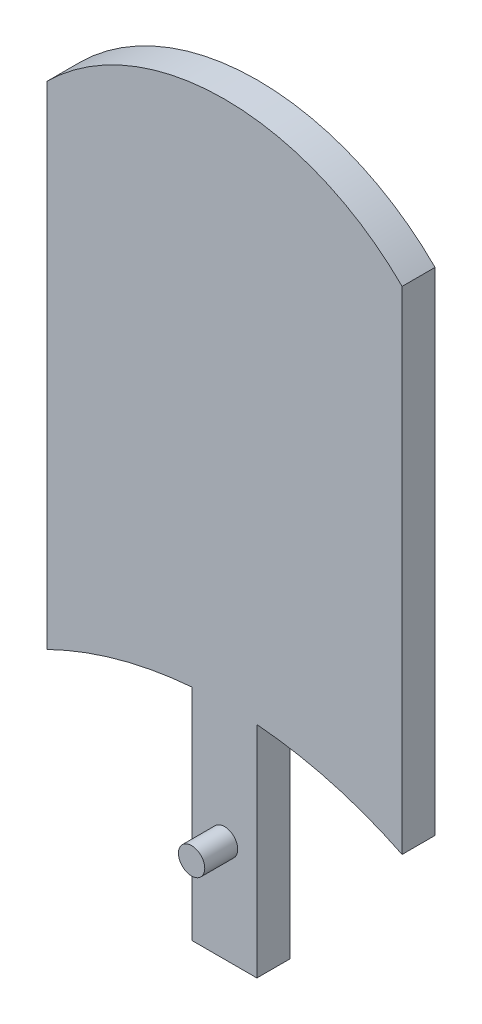
ISO-10303-21;
HEADER;
FILE_DESCRIPTION(('STEP AP214'),'2;1');
FILE_NAME('part.step','',(''),(''),'','','');
FILE_SCHEMA(('AUTOMOTIVE_DESIGN { 1 0 10303 214 1 1 1 1 }'));
ENDSEC;
DATA;
#1=APPLICATION_CONTEXT('core data for automotive mechanical design processes');
#2=APPLICATION_PROTOCOL_DEFINITION('international standard','automotive_design',2000,#1);
#3=PRODUCT_CONTEXT('',#1,'mechanical');
#4=PRODUCT('Part','Part','',(#3));
#5=PRODUCT_RELATED_PRODUCT_CATEGORY('part','',(#4));
#6=PRODUCT_DEFINITION_FORMATION('','',#4);
#7=PRODUCT_DEFINITION_CONTEXT('part definition',#1,'design');
#8=PRODUCT_DEFINITION('design','',#6,#7);
#9=PRODUCT_DEFINITION_SHAPE('','',#8);
#10=(LENGTH_UNIT() NAMED_UNIT(*) SI_UNIT(.MILLI.,.METRE.));
#11=(NAMED_UNIT(*) PLANE_ANGLE_UNIT() SI_UNIT($,.RADIAN.));
#12=(NAMED_UNIT(*) SI_UNIT($,.STERADIAN.) SOLID_ANGLE_UNIT());
#13=UNCERTAINTY_MEASURE_WITH_UNIT(LENGTH_MEASURE(1.E-05),#10,'distance_accuracy_value','');
#14=(GEOMETRIC_REPRESENTATION_CONTEXT(3) GLOBAL_UNCERTAINTY_ASSIGNED_CONTEXT((#13)) GLOBAL_UNIT_ASSIGNED_CONTEXT((#10,
#11,#12)) REPRESENTATION_CONTEXT('',''));
#15=CARTESIAN_POINT('',(0.,0.,0.));
#16=DIRECTION('',(0.,0.,1.));
#17=DIRECTION('',(1.,0.,0.));
#18=AXIS2_PLACEMENT_3D('',#15,#16,#17);
#19=CARTESIAN_POINT('',(0.,23.2983529403055,-3.175));
#20=DIRECTION('',(0.,1.,0.));
#21=DIRECTION('',(0.,0.,1.));
#22=AXIS2_PLACEMENT_3D('',#19,#20,#21);
#23=PLANE('',#22);
#24=DIRECTION('',(0.,0.,-1.));
#25=VECTOR('',#24,1.);
#26=CARTESIAN_POINT('',(0.888999999999995,23.2983529403055,6.351));
#27=LINE('',#26,#25);
#28=CARTESIAN_POINT('',(0.888999999999995,23.2983529403055,-1.972861942));
#29=VERTEX_POINT('',#28);
#30=CARTESIAN_POINT('',(0.888999999999995,23.2983529403055,-3.175));
#31=VERTEX_POINT('',#30);
#32=EDGE_CURVE('E452',#29,#31,#27,.T.);
#33=ORIENTED_EDGE('',*,*,#32,.F.);
#34=DIRECTION('',(1.,0.,0.));
#35=VECTOR('',#34,1.);
#36=CARTESIAN_POINT('',(-17.1162533328683,23.2983529403055,-1.972861942));
#37=LINE('',#36,#35);
#38=CARTESIAN_POINT('',(1.65128861988301,23.2983529403055,-1.972861942));
#39=VERTEX_POINT('',#38);
#40=EDGE_CURVE('E216',#29,#39,#37,.T.);
#41=ORIENTED_EDGE('',*,*,#40,.T.);
#42=DIRECTION('',(0.,0.,1.));
#43=VECTOR('',#42,1.);
#44=CARTESIAN_POINT('',(1.65128861988301,23.2983529403055,-3.175));
#45=LINE('',#44,#43);
#46=CARTESIAN_POINT('',(1.65128861988301,23.2983529403055,0.));
#47=VERTEX_POINT('',#46);
#48=EDGE_CURVE('E312',#39,#47,#45,.T.);
#49=ORIENTED_EDGE('',*,*,#48,.T.);
#50=DIRECTION('',(-1.,0.,0.));
#51=VECTOR('',#50,1.);
#52=CARTESIAN_POINT('',(0.,23.2983529403055,0.));
#53=LINE('',#52,#51);
#54=CARTESIAN_POINT('',(2.85342673515783,23.2983529403055,0.));
#55=VERTEX_POINT('',#54);
#56=EDGE_CURVE('E292',#55,#47,#53,.T.);
#57=ORIENTED_EDGE('',*,*,#56,.F.);
#58=DIRECTION('',(0.,0.,1.));
#59=VECTOR('',#58,1.);
#60=CARTESIAN_POINT('',(2.85342673515783,23.2983529403055,-3.175));
#61=LINE('',#60,#59);
#62=CARTESIAN_POINT('',(2.85342673515783,23.2983529403055,-3.175));
#63=VERTEX_POINT('',#62);
#64=EDGE_CURVE('E308',#63,#55,#61,.T.);
#65=ORIENTED_EDGE('',*,*,#64,.F.);
#66=DIRECTION('',(-1.,0.,0.));
#67=VECTOR('',#66,1.);
#68=CARTESIAN_POINT('',(0.,23.2983529403055,-3.175));
#69=LINE('',#68,#67);
#70=EDGE_CURVE('E274',#63,#31,#69,.T.);
#71=ORIENTED_EDGE('',*,*,#70,.T.);
#72=EDGE_LOOP('',(#33,#41,#49,#57,#65,#71));
#73=FACE_BOUND('',#72,.T.);
#74=ADVANCED_FACE('F47',(#73),#23,.T.);
#75=CARTESIAN_POINT('',(0.,0.,-3.175));
#76=DIRECTION('',(0.,0.,-1.));
#77=DIRECTION('',(-1.,0.,0.));
#78=AXIS2_PLACEMENT_3D('',#75,#76,#77);
#79=PLANE('',#78);
#80=DIRECTION('',(0.,-1.,0.));
#81=VECTOR('',#80,1.);
#82=CARTESIAN_POINT('',(0.888999999999995,-19.7679282566195,-3.175));
#83=LINE('',#82,#81);
#84=CARTESIAN_POINT('',(0.888999999999994,-19.7679282566195,-3.175));
#85=VERTEX_POINT('',#84);
#86=EDGE_CURVE('E71',#31,#85,#83,.T.);
#87=ORIENTED_EDGE('',*,*,#86,.F.);
#88=ORIENTED_EDGE('',*,*,#70,.F.);
#89=DIRECTION('',(0.,1.,0.));
#90=VECTOR('',#89,1.);
#91=CARTESIAN_POINT('',(2.85342673515783,0.,-3.175));
#92=LINE('',#91,#90);
#93=CARTESIAN_POINT('',(2.85342673515783,-19.8377816235629,-3.175));
#94=VERTEX_POINT('',#93);
#95=EDGE_CURVE('E278',#94,#63,#92,.T.);
#96=ORIENTED_EDGE('',*,*,#95,.F.);
#97=CARTESIAN_POINT('',(0.,-58.5646946603465,-3.175));
#98=DIRECTION('',(0.,0.,-1.));
#99=DIRECTION('',(-1.,0.,0.));
#100=AXIS2_PLACEMENT_3D('',#97,#98,#99);
#101=CIRCLE('',#100,38.8318920153463);
#102=CARTESIAN_POINT('',(1.65128861988301,-19.7679282566195,-3.175));
#103=VERTEX_POINT('',#102);
#104=EDGE_CURVE('E283',#94,#103,#101,.F.);
#105=ORIENTED_EDGE('',*,*,#104,.T.);
#106=DIRECTION('',(1.,0.,0.));
#107=VECTOR('',#106,1.);
#108=CARTESIAN_POINT('',(-17.1162533328683,-19.7679282566195,-3.175));
#109=LINE('',#108,#107);
#110=EDGE_CURVE('E446',#85,#103,#109,.T.);
#111=ORIENTED_EDGE('',*,*,#110,.F.);
#112=EDGE_LOOP('',(#87,#88,#96,#105,#111));
#113=FACE_BOUND('',#112,.T.);
#114=ADVANCED_FACE('F451',(#113),#79,.T.);
#115=CARTESIAN_POINT('',(-17.1162533328683,23.2983529403055,-1.972861942));
#116=DIRECTION('',(0.,0.,-1.));
#117=DIRECTION('',(0.,1.,0.));
#118=AXIS2_PLACEMENT_3D('',#115,#116,#117);
#119=PLANE('',#118);
#120=ORIENTED_EDGE('',*,*,#40,.F.);
#121=DIRECTION('',(0.,1.,0.));
#122=VECTOR('',#121,1.);
#123=CARTESIAN_POINT('',(0.888999999999995,-19.7679282566195,-1.972861942));
#124=LINE('',#123,#122);
#125=CARTESIAN_POINT('',(0.888999999999995,-19.7679282566195,-1.97286194199999));
#126=VERTEX_POINT('',#125);
#127=EDGE_CURVE('E208',#126,#29,#124,.T.);
#128=ORIENTED_EDGE('',*,*,#127,.F.);
#129=DIRECTION('',(1.,0.,0.));
#130=VECTOR('',#129,1.);
#131=CARTESIAN_POINT('',(-17.1162533328683,-19.7679282566195,-1.97286194199999));
#132=LINE('',#131,#130);
#133=CARTESIAN_POINT('',(1.65128861988301,-19.7679282566195,-1.97286194199999));
#134=VERTEX_POINT('',#133);
#135=EDGE_CURVE('E444',#126,#134,#132,.T.);
#136=ORIENTED_EDGE('',*,*,#135,.T.);
#137=DIRECTION('',(0.,1.,0.));
#138=VECTOR('',#137,1.);
#139=CARTESIAN_POINT('',(1.65128861988301,23.2983529403055,-1.972861942));
#140=LINE('',#139,#138);
#141=EDGE_CURVE('E215',#134,#39,#140,.T.);
#142=ORIENTED_EDGE('',*,*,#141,.T.);
#143=EDGE_LOOP('',(#120,#128,#136,#142));
#144=FACE_BOUND('',#143,.T.);
#145=ADVANCED_FACE('F457',(#144),#119,.F.);
#146=CARTESIAN_POINT('',(-17.1162533328683,-19.7679282566195,-1.97286194199999));
#147=DIRECTION('',(0.,1.,0.));
#148=DIRECTION('',(0.,0.,1.));
#149=AXIS2_PLACEMENT_3D('',#146,#147,#148);
#150=PLANE('',#149);
#151=ORIENTED_EDGE('',*,*,#135,.F.);
#152=DIRECTION('',(0.,0.,-1.));
#153=VECTOR('',#152,1.);
#154=CARTESIAN_POINT('',(0.888999999999995,-19.7679282566195,6.351));
#155=LINE('',#154,#153);
#156=EDGE_CURVE('E447',#126,#85,#155,.T.);
#157=ORIENTED_EDGE('',*,*,#156,.T.);
#158=ORIENTED_EDGE('',*,*,#110,.T.);
#159=DIRECTION('',(0.,0.,1.));
#160=VECTOR('',#159,1.);
#161=CARTESIAN_POINT('',(1.65128861988301,-19.7679282566195,-3.175));
#162=LINE('',#161,#160);
#163=EDGE_CURVE('E300',#103,#134,#162,.T.);
#164=ORIENTED_EDGE('',*,*,#163,.T.);
#165=EDGE_LOOP('',(#151,#157,#158,#164));
#166=FACE_BOUND('',#165,.T.);
#167=ADVANCED_FACE('F443',(#166),#150,.F.);
#168=CARTESIAN_POINT('',(-1.65128861988301,0.,-3.175));
#169=DIRECTION('',(1.,0.,0.));
#170=DIRECTION('',(0.,0.,-1.));
#171=AXIS2_PLACEMENT_3D('',#168,#169,#170);
#172=PLANE('',#171);
#173=DIRECTION('',(0.,0.,1.));
#174=VECTOR('',#173,1.);
#175=CARTESIAN_POINT('',(-1.65128861988301,-19.7679282566195,-3.175));
#176=LINE('',#175,#174);
#177=CARTESIAN_POINT('',(-1.65128861988301,-19.7679282566195,-1.97286194199999));
#178=VERTEX_POINT('',#177);
#179=CARTESIAN_POINT('',(-1.65128861988301,-19.7679282566195,0.));
#180=VERTEX_POINT('',#179);
#181=EDGE_CURVE('E325',#178,#180,#176,.T.);
#182=ORIENTED_EDGE('',*,*,#181,.F.);
#183=DIRECTION('',(0.,-1.,0.));
#184=VECTOR('',#183,1.);
#185=CARTESIAN_POINT('',(-1.65128861988301,23.2983529403055,-1.972861942));
#186=LINE('',#185,#184);
#187=CARTESIAN_POINT('',(-1.65128861988301,23.2983529403055,-1.972861942));
#188=VERTEX_POINT('',#187);
#189=EDGE_CURVE('E196',#188,#178,#186,.T.);
#190=ORIENTED_EDGE('',*,*,#189,.F.);
#191=DIRECTION('',(0.,0.,1.));
#192=VECTOR('',#191,1.);
#193=CARTESIAN_POINT('',(-1.65128861988301,23.2983529403055,-3.175));
#194=LINE('',#193,#192);
#195=CARTESIAN_POINT('',(-1.65128861988301,23.2983529403055,0.));
#196=VERTEX_POINT('',#195);
#197=EDGE_CURVE('E213',#188,#196,#194,.T.);
#198=ORIENTED_EDGE('',*,*,#197,.T.);
#199=DIRECTION('',(0.,1.,0.));
#200=VECTOR('',#199,1.);
#201=CARTESIAN_POINT('',(-1.65128861988301,0.,0.));
#202=LINE('',#201,#200);
#203=EDGE_CURVE('E321',#180,#196,#202,.T.);
#204=ORIENTED_EDGE('',*,*,#203,.F.);
#205=EDGE_LOOP('',(#182,#190,#198,#204));
#206=FACE_BOUND('',#205,.T.);
#207=ADVANCED_FACE('F514',(#206),#172,.T.);
#208=CARTESIAN_POINT('',(1.65128861988301,0.,-3.175));
#209=DIRECTION('',(1.,0.,0.));
#210=DIRECTION('',(0.,0.,-1.));
#211=AXIS2_PLACEMENT_3D('',#208,#209,#210);
#212=PLANE('',#211);
#213=ORIENTED_EDGE('',*,*,#141,.F.);
#214=CARTESIAN_POINT('',(1.65128861988301,-19.7679282566195,0.));
#215=VERTEX_POINT('',#214);
#216=EDGE_CURVE('E287',#134,#215,#162,.T.);
#217=ORIENTED_EDGE('',*,*,#216,.T.);
#218=DIRECTION('',(0.,1.,0.));
#219=VECTOR('',#218,1.);
#220=CARTESIAN_POINT('',(1.65128861988301,0.,0.));
#221=LINE('',#220,#219);
#222=EDGE_CURVE('E288',#215,#47,#221,.T.);
#223=ORIENTED_EDGE('',*,*,#222,.T.);
#224=ORIENTED_EDGE('',*,*,#48,.F.);
#225=EDGE_LOOP('',(#213,#217,#223,#224));
#226=FACE_BOUND('',#225,.T.);
#227=ADVANCED_FACE('F440',(#226),#212,.F.);
#228=CARTESIAN_POINT('',(0.,-58.5646946603465,3.175));
#229=DIRECTION('',(0.,0.,-1.));
#230=DIRECTION('',(-1.,0.,0.));
#231=AXIS2_PLACEMENT_3D('',#228,#229,#230);
#232=CYLINDRICAL_SURFACE('',#231,38.8318920153463);
#233=CARTESIAN_POINT('',(0.,-58.5646946603465,3.175));
#234=DIRECTION('',(0.,0.,1.));
#235=DIRECTION('',(1.,0.,0.));
#236=AXIS2_PLACEMENT_3D('',#233,#234,#235);
#237=CIRCLE('',#236,38.8318920153463);
#238=CARTESIAN_POINT('',(3.11847985069032,-19.8582233549904,3.175));
#239=VERTEX_POINT('',#238);
#240=CARTESIAN_POINT('',(17.1142533328683,-23.707583903,3.175));
#241=VERTEX_POINT('',#240);
#242=EDGE_CURVE('E357',#239,#241,#237,.F.);
#243=ORIENTED_EDGE('',*,*,#242,.F.);
#244=DIRECTION('',(0.,0.,-1.));
#245=VECTOR('',#244,1.);
#246=CARTESIAN_POINT('',(3.11847985069032,-19.8582233549904,3.175));
#247=LINE('',#246,#245);
#248=CARTESIAN_POINT('',(3.11847985069032,-19.8582233549904,0.));
#249=VERTEX_POINT('',#248);
#250=EDGE_CURVE('E269',#239,#249,#247,.T.);
#251=ORIENTED_EDGE('',*,*,#250,.T.);
#252=CARTESIAN_POINT('',(0.,-58.5646946603465,0.));
#253=DIRECTION('',(0.,0.,1.));
#254=DIRECTION('',(1.,0.,0.));
#255=AXIS2_PLACEMENT_3D('',#252,#253,#254);
#256=CIRCLE('',#255,38.8318920153463);
#257=CARTESIAN_POINT('',(17.1142533328683,-23.707583903,0.));
#258=VERTEX_POINT('',#257);
#259=EDGE_CURVE('E373',#249,#258,#256,.F.);
#260=ORIENTED_EDGE('',*,*,#259,.T.);
#261=DIRECTION('',(0.,0.,-1.));
#262=VECTOR('',#261,1.);
#263=CARTESIAN_POINT('',(17.1142533328683,-23.707583903,3.175));
#264=LINE('',#263,#262);
#265=EDGE_CURVE('E383',#241,#258,#264,.T.);
#266=ORIENTED_EDGE('',*,*,#265,.F.);
#267=EDGE_LOOP('',(#243,#251,#260,#266));
#268=FACE_BOUND('',#267,.T.);
#269=ADVANCED_FACE('F413',(#268),#232,.F.);
#270=CARTESIAN_POINT('',(0.,-58.5646946603465,0.));
#271=DIRECTION('',(0.,0.,1.));
#272=DIRECTION('',(1.,0.,0.));
#273=AXIS2_PLACEMENT_3D('',#270,#271,#272);
#274=CIRCLE('',#273,38.8318920153463);
#275=CARTESIAN_POINT('',(-2.85342673515783,-19.8377816235629,0.));
#276=VERTEX_POINT('',#275);
#277=EDGE_CURVE('E261',#276,#180,#274,.F.);
#278=ORIENTED_EDGE('',*,*,#277,.F.);
#279=DIRECTION('',(0.,0.,1.));
#280=VECTOR('',#279,1.);
#281=CARTESIAN_POINT('',(-2.85342673515783,-19.8377816235629,-3.175));
#282=LINE('',#281,#280);
#283=CARTESIAN_POINT('',(-2.85342673515783,-19.8377816235629,-3.175));
#284=VERTEX_POINT('',#283);
#285=EDGE_CURVE('E293',#284,#276,#282,.T.);
#286=ORIENTED_EDGE('',*,*,#285,.F.);
#287=CARTESIAN_POINT('',(0.,-58.5646946603465,-3.175));
#288=DIRECTION('',(0.,0.,-1.));
#289=DIRECTION('',(-1.,0.,0.));
#290=AXIS2_PLACEMENT_3D('',#287,#288,#289);
#291=CIRCLE('',#290,38.8318920153463);
#292=CARTESIAN_POINT('',(-1.65128861988301,-19.7679282566195,-3.175));
#293=VERTEX_POINT('',#292);
#294=EDGE_CURVE('E316',#293,#284,#291,.F.);
#295=ORIENTED_EDGE('',*,*,#294,.F.);
#296=EDGE_CURVE('E335',#293,#178,#176,.T.);
#297=ORIENTED_EDGE('',*,*,#296,.T.);
#298=ORIENTED_EDGE('',*,*,#181,.T.);
#299=EDGE_LOOP('',(#278,#286,#295,#297,#298));
#300=FACE_BOUND('',#299,.T.);
#301=ADVANCED_FACE('F603',(#300),#232,.F.);
#302=CARTESIAN_POINT('',(2.85342673515783,-19.8377816235629,0.));
#303=VERTEX_POINT('',#302);
#304=EDGE_CURVE('E257',#215,#303,#274,.F.);
#305=ORIENTED_EDGE('',*,*,#304,.F.);
#306=ORIENTED_EDGE('',*,*,#216,.F.);
#307=ORIENTED_EDGE('',*,*,#163,.F.);
#308=ORIENTED_EDGE('',*,*,#104,.F.);
#309=DIRECTION('',(0.,0.,1.));
#310=VECTOR('',#309,1.);
#311=CARTESIAN_POINT('',(2.85342673515783,-19.8377816235629,-3.175));
#312=LINE('',#311,#310);
#313=EDGE_CURVE('E304',#94,#303,#312,.T.);
#314=ORIENTED_EDGE('',*,*,#313,.T.);
#315=EDGE_LOOP('',(#305,#306,#307,#308,#314));
#316=FACE_BOUND('',#315,.T.);
#317=ADVANCED_FACE('F427',(#316),#232,.F.);
#318=CARTESIAN_POINT('',(0.,0.,0.));
#319=DIRECTION('',(0.,0.,1.));
#320=DIRECTION('',(1.,0.,0.));
#321=AXIS2_PLACEMENT_3D('',#318,#319,#320);
#322=PLANE('',#321);
#323=DIRECTION('',(0.,-1.,0.));
#324=VECTOR('',#323,1.);
#325=CARTESIAN_POINT('',(-3.11847985069032,0.338888516574702,0.));
#326=LINE('',#325,#324);
#327=CARTESIAN_POINT('',(-3.11847985069039,-19.8582233549904,0.));
#328=VERTEX_POINT('',#327);
#329=CARTESIAN_POINT('',(-3.11847985069047,-41.0138230374253,0.));
#330=VERTEX_POINT('',#329);
#331=EDGE_CURVE('E237',#328,#330,#326,.T.);
#332=ORIENTED_EDGE('',*,*,#331,.F.);
#333=CARTESIAN_POINT('',(-17.1142533328683,-23.707583903,0.));
#334=VERTEX_POINT('',#333);
#335=EDGE_CURVE('E374',#334,#328,#256,.F.);
#336=ORIENTED_EDGE('',*,*,#335,.F.);
#337=DIRECTION('',(0.,1.,0.));
#338=VECTOR('',#337,1.);
#339=CARTESIAN_POINT('',(-17.1142533328683,0.,0.));
#340=LINE('',#339,#338);
#341=CARTESIAN_POINT('',(-17.1142533328683,23.707583903,0.));
#342=VERTEX_POINT('',#341);
#343=EDGE_CURVE('E369',#334,#342,#340,.T.);
#344=ORIENTED_EDGE('',*,*,#343,.T.);
#345=CARTESIAN_POINT('',(0.,6.54428719014116,0.));
#346=DIRECTION('',(0.,0.,1.));
#347=DIRECTION('',(1.,0.,0.));
#348=AXIS2_PLACEMENT_3D('',#345,#346,#347);
#349=CIRCLE('',#348,24.2379128885971);
#350=CARTESIAN_POINT('',(17.1142533328683,23.707583903,0.));
#351=VERTEX_POINT('',#350);
#352=EDGE_CURVE('E315',#342,#351,#349,.F.);
#353=ORIENTED_EDGE('',*,*,#352,.T.);
#354=DIRECTION('',(0.,1.,0.));
#355=VECTOR('',#354,1.);
#356=CARTESIAN_POINT('',(17.1142533328683,0.,0.));
#357=LINE('',#356,#355);
#358=EDGE_CURVE('E353',#258,#351,#357,.T.);
#359=ORIENTED_EDGE('',*,*,#358,.F.);
#360=ORIENTED_EDGE('',*,*,#259,.F.);
#361=DIRECTION('',(0.,1.,0.));
#362=VECTOR('',#361,1.);
#363=CARTESIAN_POINT('',(3.11847985069032,0.338888516574709,0.));
#364=LINE('',#363,#362);
#365=CARTESIAN_POINT('',(3.11847985069032,-41.0138230374253,0.));
#366=VERTEX_POINT('',#365);
#367=EDGE_CURVE('E234',#366,#249,#364,.T.);
#368=ORIENTED_EDGE('',*,*,#367,.F.);
#369=DIRECTION('',(1.,0.,0.));
#370=VECTOR('',#369,1.);
#371=CARTESIAN_POINT('',(-3.11847985069047,-41.0138230374253,0.));
#372=LINE('',#371,#370);
#373=EDGE_CURVE('E241',#330,#366,#372,.T.);
#374=ORIENTED_EDGE('',*,*,#373,.F.);
#375=EDGE_LOOP('',(#332,#336,#344,#353,#359,#360,#368,#374));
#376=FACE_BOUND('',#375,.T.);
#377=DIRECTION('',(0.,1.,0.));
#378=VECTOR('',#377,1.);
#379=CARTESIAN_POINT('',(2.85342673515783,0.,0.));
#380=LINE('',#379,#378);
#381=EDGE_CURVE('E297',#303,#55,#380,.T.);
#382=ORIENTED_EDGE('',*,*,#381,.T.);
#383=ORIENTED_EDGE('',*,*,#56,.T.);
#384=ORIENTED_EDGE('',*,*,#222,.F.);
#385=ORIENTED_EDGE('',*,*,#304,.T.);
#386=EDGE_LOOP('',(#382,#383,#384,#385));
#387=FACE_BOUND('',#386,.T.);
#388=ORIENTED_EDGE('',*,*,#203,.T.);
#389=DIRECTION('',(-1.,0.,0.));
#390=VECTOR('',#389,1.);
#391=CARTESIAN_POINT('',(0.,23.2983529403055,0.));
#392=LINE('',#391,#390);
#393=CARTESIAN_POINT('',(-2.85342673515783,23.2983529403055,0.));
#394=VERTEX_POINT('',#393);
#395=EDGE_CURVE('E328',#196,#394,#392,.T.);
#396=ORIENTED_EDGE('',*,*,#395,.T.);
#397=DIRECTION('',(0.,1.,0.));
#398=VECTOR('',#397,1.);
#399=CARTESIAN_POINT('',(-2.85342673515783,0.,0.));
#400=LINE('',#399,#398);
#401=EDGE_CURVE('E273',#276,#394,#400,.T.);
#402=ORIENTED_EDGE('',*,*,#401,.F.);
#403=ORIENTED_EDGE('',*,*,#277,.T.);
#404=EDGE_LOOP('',(#388,#396,#402,#403));
#405=FACE_BOUND('',#404,.T.);
#406=ADVANCED_FACE('F396',(#376,#387,#405),#322,.F.);
#407=CARTESIAN_POINT('',(0.,6.54428719014116,3.175));
#408=DIRECTION('',(0.,0.,-1.));
#409=DIRECTION('',(-1.,0.,0.));
#410=AXIS2_PLACEMENT_3D('',#407,#408,#409);
#411=CYLINDRICAL_SURFACE('',#410,24.2379128885971);
#412=ORIENTED_EDGE('',*,*,#352,.F.);
#413=DIRECTION('',(0.,0.,-1.));
#414=VECTOR('',#413,1.);
#415=CARTESIAN_POINT('',(-17.1142533328683,23.707583903,3.175));
#416=LINE('',#415,#414);
#417=CARTESIAN_POINT('',(-17.1142533328683,23.707583903,3.175));
#418=VERTEX_POINT('',#417);
#419=EDGE_CURVE('E11',#418,#342,#416,.T.);
#420=ORIENTED_EDGE('',*,*,#419,.F.);
#421=CARTESIAN_POINT('',(0.,6.54428719014116,3.175));
#422=DIRECTION('',(0.,0.,1.));
#423=DIRECTION('',(1.,0.,0.));
#424=AXIS2_PLACEMENT_3D('',#421,#422,#423);
#425=CIRCLE('',#424,24.2379128885971);
#426=CARTESIAN_POINT('',(17.1142533328683,23.707583903,3.175));
#427=VERTEX_POINT('',#426);
#428=EDGE_CURVE('E348',#418,#427,#425,.F.);
#429=ORIENTED_EDGE('',*,*,#428,.T.);
#430=DIRECTION('',(0.,0.,-1.));
#431=VECTOR('',#430,1.);
#432=CARTESIAN_POINT('',(17.1142533328683,23.707583903,3.175));
#433=LINE('',#432,#431);
#434=EDGE_CURVE('E365',#427,#351,#433,.T.);
#435=ORIENTED_EDGE('',*,*,#434,.T.);
#436=EDGE_LOOP('',(#412,#420,#429,#435));
#437=FACE_BOUND('',#436,.T.);
#438=ADVANCED_FACE('F49',(#437),#411,.T.);
#439=CARTESIAN_POINT('',(-17.1142533328683,0.,3.175));
#440=DIRECTION('',(-1.,0.,0.));
#441=DIRECTION('',(0.,0.,1.));
#442=AXIS2_PLACEMENT_3D('',#439,#440,#441);
#443=PLANE('',#442);
#444=ORIENTED_EDGE('',*,*,#343,.F.);
#445=DIRECTION('',(0.,0.,-1.));
#446=VECTOR('',#445,1.);
#447=CARTESIAN_POINT('',(-17.1142533328683,-23.707583903,3.175));
#448=LINE('',#447,#446);
#449=CARTESIAN_POINT('',(-17.1142533328683,-23.707583903,3.175));
#450=VERTEX_POINT('',#449);
#451=EDGE_CURVE('E56',#450,#334,#448,.T.);
#452=ORIENTED_EDGE('',*,*,#451,.F.);
#453=DIRECTION('',(0.,1.,0.));
#454=VECTOR('',#453,1.);
#455=CARTESIAN_POINT('',(-17.1142533328683,0.,3.175));
#456=LINE('',#455,#454);
#457=EDGE_CURVE('E352',#450,#418,#456,.T.);
#458=ORIENTED_EDGE('',*,*,#457,.T.);
#459=ORIENTED_EDGE('',*,*,#419,.T.);
#460=EDGE_LOOP('',(#444,#452,#458,#459));
#461=FACE_BOUND('',#460,.T.);
#462=ADVANCED_FACE('F399',(#461),#443,.T.);
#463=ORIENTED_EDGE('',*,*,#335,.T.);
#464=DIRECTION('',(0.,0.,-1.));
#465=VECTOR('',#464,1.);
#466=CARTESIAN_POINT('',(-3.11847985069039,-19.8582233549904,3.175));
#467=LINE('',#466,#465);
#468=CARTESIAN_POINT('',(-3.11847985069039,-19.8582233549904,3.175));
#469=VERTEX_POINT('',#468);
#470=EDGE_CURVE('E265',#328,#469,#467,.F.);
#471=ORIENTED_EDGE('',*,*,#470,.T.);
#472=EDGE_CURVE('E358',#450,#469,#237,.F.);
#473=ORIENTED_EDGE('',*,*,#472,.F.);
#474=ORIENTED_EDGE('',*,*,#451,.T.);
#475=EDGE_LOOP('',(#463,#471,#473,#474));
#476=FACE_BOUND('',#475,.T.);
#477=ADVANCED_FACE('F390',(#476),#232,.F.);
#478=CARTESIAN_POINT('',(17.1142533328683,0.,3.175));
#479=DIRECTION('',(-1.,0.,0.));
#480=DIRECTION('',(0.,0.,1.));
#481=AXIS2_PLACEMENT_3D('',#478,#479,#480);
#482=PLANE('',#481);
#483=ORIENTED_EDGE('',*,*,#358,.T.);
#484=ORIENTED_EDGE('',*,*,#434,.F.);
#485=DIRECTION('',(0.,1.,0.));
#486=VECTOR('',#485,1.);
#487=CARTESIAN_POINT('',(17.1142533328683,0.,3.175));
#488=LINE('',#487,#486);
#489=EDGE_CURVE('E362',#241,#427,#488,.T.);
#490=ORIENTED_EDGE('',*,*,#489,.F.);
#491=ORIENTED_EDGE('',*,*,#265,.T.);
#492=EDGE_LOOP('',(#483,#484,#490,#491));
#493=FACE_BOUND('',#492,.T.);
#494=ADVANCED_FACE('F408',(#493),#482,.F.);
#495=CARTESIAN_POINT('',(0.,0.,3.175));
#496=DIRECTION('',(0.,0.,1.));
#497=DIRECTION('',(1.,0.,0.));
#498=AXIS2_PLACEMENT_3D('',#495,#496,#497);
#499=PLANE('',#498);
#500=CARTESIAN_POINT('',(0.,-31.2016834034253,3.175));
#501=DIRECTION('',(0.,0.,1.));
#502=DIRECTION('',(1.,0.,0.));
#503=AXIS2_PLACEMENT_3D('',#500,#501,#502);
#504=CIRCLE('',#503,1.27);
#505=CARTESIAN_POINT('',(1.27,-31.2016834034253,3.175));
#506=VERTEX_POINT('',#505);
#507=EDGE_CURVE('E221',#506,#506,#504,.T.);
#508=ORIENTED_EDGE('',*,*,#507,.F.);
#509=EDGE_LOOP('',(#508));
#510=FACE_BOUND('',#509,.T.);
#511=ORIENTED_EDGE('',*,*,#472,.T.);
#512=DIRECTION('',(0.,-1.,0.));
#513=VECTOR('',#512,1.);
#514=CARTESIAN_POINT('',(-3.11847985069032,0.338888516574702,3.175));
#515=LINE('',#514,#513);
#516=CARTESIAN_POINT('',(-3.11847985069047,-41.0138230374253,3.175));
#517=VERTEX_POINT('',#516);
#518=EDGE_CURVE('E248',#469,#517,#515,.T.);
#519=ORIENTED_EDGE('',*,*,#518,.T.);
#520=DIRECTION('',(1.,0.,0.));
#521=VECTOR('',#520,1.);
#522=CARTESIAN_POINT('',(-3.11847985069047,-41.0138230374253,3.175));
#523=LINE('',#522,#521);
#524=CARTESIAN_POINT('',(3.11847985069032,-41.0138230374253,3.175));
#525=VERTEX_POINT('',#524);
#526=EDGE_CURVE('E238',#517,#525,#523,.T.);
#527=ORIENTED_EDGE('',*,*,#526,.T.);
#528=DIRECTION('',(0.,1.,0.));
#529=VECTOR('',#528,1.);
#530=CARTESIAN_POINT('',(3.11847985069032,0.338888516574709,3.175));
#531=LINE('',#530,#529);
#532=EDGE_CURVE('E230',#525,#239,#531,.T.);
#533=ORIENTED_EDGE('',*,*,#532,.T.);
#534=ORIENTED_EDGE('',*,*,#242,.T.);
#535=ORIENTED_EDGE('',*,*,#489,.T.);
#536=ORIENTED_EDGE('',*,*,#428,.F.);
#537=ORIENTED_EDGE('',*,*,#457,.F.);
#538=EDGE_LOOP('',(#511,#519,#527,#533,#534,#535,#536,#537));
#539=FACE_BOUND('',#538,.T.);
#540=ADVANCED_FACE('F504',(#510,#539),#499,.T.);
#541=CARTESIAN_POINT('',(-2.85342673515783,0.,-3.175));
#542=DIRECTION('',(1.,0.,0.));
#543=DIRECTION('',(0.,0.,-1.));
#544=AXIS2_PLACEMENT_3D('',#541,#542,#543);
#545=PLANE('',#544);
#546=ORIENTED_EDGE('',*,*,#401,.T.);
#547=DIRECTION('',(0.,0.,1.));
#548=VECTOR('',#547,1.);
#549=CARTESIAN_POINT('',(-2.85342673515783,23.2983529403055,-3.175));
#550=LINE('',#549,#548);
#551=CARTESIAN_POINT('',(-2.85342673515783,23.2983529403055,-3.175));
#552=VERTEX_POINT('',#551);
#553=EDGE_CURVE('E341',#552,#394,#550,.T.);
#554=ORIENTED_EDGE('',*,*,#553,.F.);
#555=DIRECTION('',(0.,1.,0.));
#556=VECTOR('',#555,1.);
#557=CARTESIAN_POINT('',(-2.85342673515783,0.,-3.175));
#558=LINE('',#557,#556);
#559=EDGE_CURVE('E320',#284,#552,#558,.T.);
#560=ORIENTED_EDGE('',*,*,#559,.F.);
#561=ORIENTED_EDGE('',*,*,#285,.T.);
#562=EDGE_LOOP('',(#546,#554,#560,#561));
#563=FACE_BOUND('',#562,.T.);
#564=ADVANCED_FACE('F497',(#563),#545,.F.);
#565=DIRECTION('',(0.,0.,-1.));
#566=VECTOR('',#565,1.);
#567=CARTESIAN_POINT('',(-0.889,23.2983529403055,6.351));
#568=LINE('',#567,#566);
#569=CARTESIAN_POINT('',(-0.889000000000001,23.2983529403055,-1.972861942));
#570=VERTEX_POINT('',#569);
#571=CARTESIAN_POINT('',(-0.889,23.2983529403055,-3.175));
#572=VERTEX_POINT('',#571);
#573=EDGE_CURVE('E188',#570,#572,#568,.T.);
#574=ORIENTED_EDGE('',*,*,#573,.T.);
#575=EDGE_CURVE('E279',#572,#552,#69,.T.);
#576=ORIENTED_EDGE('',*,*,#575,.T.);
#577=ORIENTED_EDGE('',*,*,#553,.T.);
#578=ORIENTED_EDGE('',*,*,#395,.F.);
#579=ORIENTED_EDGE('',*,*,#197,.F.);
#580=EDGE_CURVE('E204',#188,#570,#37,.T.);
#581=ORIENTED_EDGE('',*,*,#580,.T.);
#582=EDGE_LOOP('',(#574,#576,#577,#578,#579,#581));
#583=FACE_BOUND('',#582,.T.);
#584=ADVANCED_FACE('F211',(#583),#23,.T.);
#585=CARTESIAN_POINT('',(2.85342673515783,0.,-3.175));
#586=DIRECTION('',(1.,0.,0.));
#587=DIRECTION('',(0.,0.,-1.));
#588=AXIS2_PLACEMENT_3D('',#585,#586,#587);
#589=PLANE('',#588);
#590=ORIENTED_EDGE('',*,*,#381,.F.);
#591=ORIENTED_EDGE('',*,*,#313,.F.);
#592=ORIENTED_EDGE('',*,*,#95,.T.);
#593=ORIENTED_EDGE('',*,*,#64,.T.);
#594=EDGE_LOOP('',(#590,#591,#592,#593));
#595=FACE_BOUND('',#594,.T.);
#596=ADVANCED_FACE('F431',(#595),#589,.T.);
#597=DIRECTION('',(0.,1.,0.));
#598=VECTOR('',#597,1.);
#599=CARTESIAN_POINT('',(-0.889,23.2983529403055,-3.175));
#600=LINE('',#599,#598);
#601=CARTESIAN_POINT('',(-0.889000000000005,-19.7679282566195,-3.175));
#602=VERTEX_POINT('',#601);
#603=EDGE_CURVE('E191',#602,#572,#600,.T.);
#604=ORIENTED_EDGE('',*,*,#603,.F.);
#605=EDGE_CURVE('E450',#293,#602,#109,.T.);
#606=ORIENTED_EDGE('',*,*,#605,.F.);
#607=ORIENTED_EDGE('',*,*,#294,.T.);
#608=ORIENTED_EDGE('',*,*,#559,.T.);
#609=ORIENTED_EDGE('',*,*,#575,.F.);
#610=EDGE_LOOP('',(#604,#606,#607,#608,#609));
#611=FACE_BOUND('',#610,.T.);
#612=ADVANCED_FACE('F493',(#611),#79,.T.);
#613=CARTESIAN_POINT('',(3.11847985069032,0.338888516574709,0.));
#614=DIRECTION('',(1.,0.,0.));
#615=DIRECTION('',(0.,1.,0.));
#616=AXIS2_PLACEMENT_3D('',#613,#614,#615);
#617=PLANE('',#616);
#618=ORIENTED_EDGE('',*,*,#250,.F.);
#619=ORIENTED_EDGE('',*,*,#532,.F.);
#620=DIRECTION('',(0.,0.,1.));
#621=VECTOR('',#620,1.);
#622=CARTESIAN_POINT('',(3.11847985069032,-41.0138230374253,0.));
#623=LINE('',#622,#621);
#624=EDGE_CURVE('E254',#366,#525,#623,.T.);
#625=ORIENTED_EDGE('',*,*,#624,.F.);
#626=ORIENTED_EDGE('',*,*,#367,.T.);
#627=EDGE_LOOP('',(#618,#619,#625,#626));
#628=FACE_BOUND('',#627,.T.);
#629=ADVANCED_FACE('F594',(#628),#617,.T.);
#630=CARTESIAN_POINT('',(-3.11847985069032,0.338888516574702,0.));
#631=DIRECTION('',(-1.,0.,0.));
#632=DIRECTION('',(0.,-1.,0.));
#633=AXIS2_PLACEMENT_3D('',#630,#631,#632);
#634=PLANE('',#633);
#635=ORIENTED_EDGE('',*,*,#470,.F.);
#636=ORIENTED_EDGE('',*,*,#331,.T.);
#637=DIRECTION('',(0.,0.,1.));
#638=VECTOR('',#637,1.);
#639=CARTESIAN_POINT('',(-3.11847985069047,-41.0138230374253,0.));
#640=LINE('',#639,#638);
#641=EDGE_CURVE('E245',#330,#517,#640,.T.);
#642=ORIENTED_EDGE('',*,*,#641,.T.);
#643=ORIENTED_EDGE('',*,*,#518,.F.);
#644=EDGE_LOOP('',(#635,#636,#642,#643));
#645=FACE_BOUND('',#644,.T.);
#646=ADVANCED_FACE('F629',(#645),#634,.T.);
#647=CARTESIAN_POINT('',(-3.11847985069047,-41.0138230374253,0.));
#648=DIRECTION('',(0.,-1.,0.));
#649=DIRECTION('',(0.,0.,-1.));
#650=AXIS2_PLACEMENT_3D('',#647,#648,#649);
#651=PLANE('',#650);
#652=ORIENTED_EDGE('',*,*,#526,.F.);
#653=ORIENTED_EDGE('',*,*,#641,.F.);
#654=ORIENTED_EDGE('',*,*,#373,.T.);
#655=ORIENTED_EDGE('',*,*,#624,.T.);
#656=EDGE_LOOP('',(#652,#653,#654,#655));
#657=FACE_BOUND('',#656,.T.);
#658=ADVANCED_FACE('F638',(#657),#651,.T.);
#659=CARTESIAN_POINT('',(0.,-31.2016834034253,6.35));
#660=DIRECTION('',(0.,0.,-1.));
#661=DIRECTION('',(-1.,0.,0.));
#662=AXIS2_PLACEMENT_3D('',#659,#660,#661);
#663=CYLINDRICAL_SURFACE('',#662,1.27);
#664=CARTESIAN_POINT('',(0.,-31.2016834034253,6.35));
#665=DIRECTION('',(0.,0.,1.));
#666=DIRECTION('',(1.,0.,0.));
#667=AXIS2_PLACEMENT_3D('',#664,#665,#666);
#668=CIRCLE('',#667,1.27);
#669=CARTESIAN_POINT('',(1.27,-31.2016834034253,6.35));
#670=VERTEX_POINT('',#669);
#671=EDGE_CURVE('E226',#670,#670,#668,.T.);
#672=ORIENTED_EDGE('',*,*,#671,.F.);
#673=EDGE_LOOP('',(#672));
#674=FACE_BOUND('',#673,.T.);
#675=ORIENTED_EDGE('',*,*,#507,.T.);
#676=EDGE_LOOP('',(#675));
#677=FACE_BOUND('',#676,.T.);
#678=ADVANCED_FACE('F647',(#674,#677),#663,.T.);
#679=CARTESIAN_POINT('',(0.,0.,6.35));
#680=DIRECTION('',(0.,0.,1.));
#681=DIRECTION('',(1.,0.,0.));
#682=AXIS2_PLACEMENT_3D('',#679,#680,#681);
#683=PLANE('',#682);
#684=ORIENTED_EDGE('',*,*,#671,.T.);
#685=EDGE_LOOP('',(#684));
#686=FACE_BOUND('',#685,.T.);
#687=ADVANCED_FACE('F656',(#686),#683,.T.);
#688=CARTESIAN_POINT('',(-0.889000000000008,-19.7679282566195,-1.97286194199999));
#689=VERTEX_POINT('',#688);
#690=EDGE_CURVE('E206',#178,#689,#132,.T.);
#691=ORIENTED_EDGE('',*,*,#690,.T.);
#692=DIRECTION('',(0.,-1.,0.));
#693=VECTOR('',#692,1.);
#694=CARTESIAN_POINT('',(-0.889,23.2983529403055,-1.972861942));
#695=LINE('',#694,#693);
#696=EDGE_CURVE('E63',#570,#689,#695,.T.);
#697=ORIENTED_EDGE('',*,*,#696,.F.);
#698=ORIENTED_EDGE('',*,*,#580,.F.);
#699=ORIENTED_EDGE('',*,*,#189,.T.);
#700=EDGE_LOOP('',(#691,#697,#698,#699));
#701=FACE_BOUND('',#700,.T.);
#702=ADVANCED_FACE('F202',(#701),#119,.F.);
#703=ORIENTED_EDGE('',*,*,#605,.T.);
#704=DIRECTION('',(0.,0.,-1.));
#705=VECTOR('',#704,1.);
#706=CARTESIAN_POINT('',(-0.889000000000005,-19.7679282566195,6.351));
#707=LINE('',#706,#705);
#708=EDGE_CURVE('E197',#689,#602,#707,.T.);
#709=ORIENTED_EDGE('',*,*,#708,.F.);
#710=ORIENTED_EDGE('',*,*,#690,.F.);
#711=ORIENTED_EDGE('',*,*,#296,.F.);
#712=EDGE_LOOP('',(#703,#709,#710,#711));
#713=FACE_BOUND('',#712,.T.);
#714=ADVANCED_FACE('F483',(#713),#150,.F.);
#715=CARTESIAN_POINT('',(-0.889,23.2983529403055,6.351));
#716=DIRECTION('',(-1.,0.,0.));
#717=DIRECTION('',(0.,-1.,0.));
#718=AXIS2_PLACEMENT_3D('',#715,#716,#717);
#719=PLANE('',#718);
#720=ORIENTED_EDGE('',*,*,#696,.T.);
#721=ORIENTED_EDGE('',*,*,#708,.T.);
#722=ORIENTED_EDGE('',*,*,#603,.T.);
#723=ORIENTED_EDGE('',*,*,#573,.F.);
#724=EDGE_LOOP('',(#720,#721,#722,#723));
#725=FACE_BOUND('',#724,.T.);
#726=ADVANCED_FACE('F189',(#725),#719,.F.);
#727=CARTESIAN_POINT('',(0.888999999999995,-19.7679282566195,6.351));
#728=DIRECTION('',(1.,0.,0.));
#729=DIRECTION('',(0.,1.,0.));
#730=AXIS2_PLACEMENT_3D('',#727,#728,#729);
#731=PLANE('',#730);
#732=ORIENTED_EDGE('',*,*,#127,.T.);
#733=ORIENTED_EDGE('',*,*,#32,.T.);
#734=ORIENTED_EDGE('',*,*,#86,.T.);
#735=ORIENTED_EDGE('',*,*,#156,.F.);
#736=EDGE_LOOP('',(#732,#733,#734,#735));
#737=FACE_BOUND('',#736,.T.);
#738=ADVANCED_FACE('F477',(#737),#731,.F.);
#739=CLOSED_SHELL('',(#74,#114,#145,#167,#207,#227,#269,#301,#317,#406,#438,#462,#477,#494,#540,
#564,#584,#596,#612,#629,#646,#658,#678,#687,#702,#714,#726,#738));
#740=MANIFOLD_SOLID_BREP('B2',#739);
#741=ADVANCED_BREP_SHAPE_REPRESENTATION('',(#18,#740),#14);
#742=SHAPE_DEFINITION_REPRESENTATION(#9,#741);
ENDSEC;
END-ISO-10303-21;
